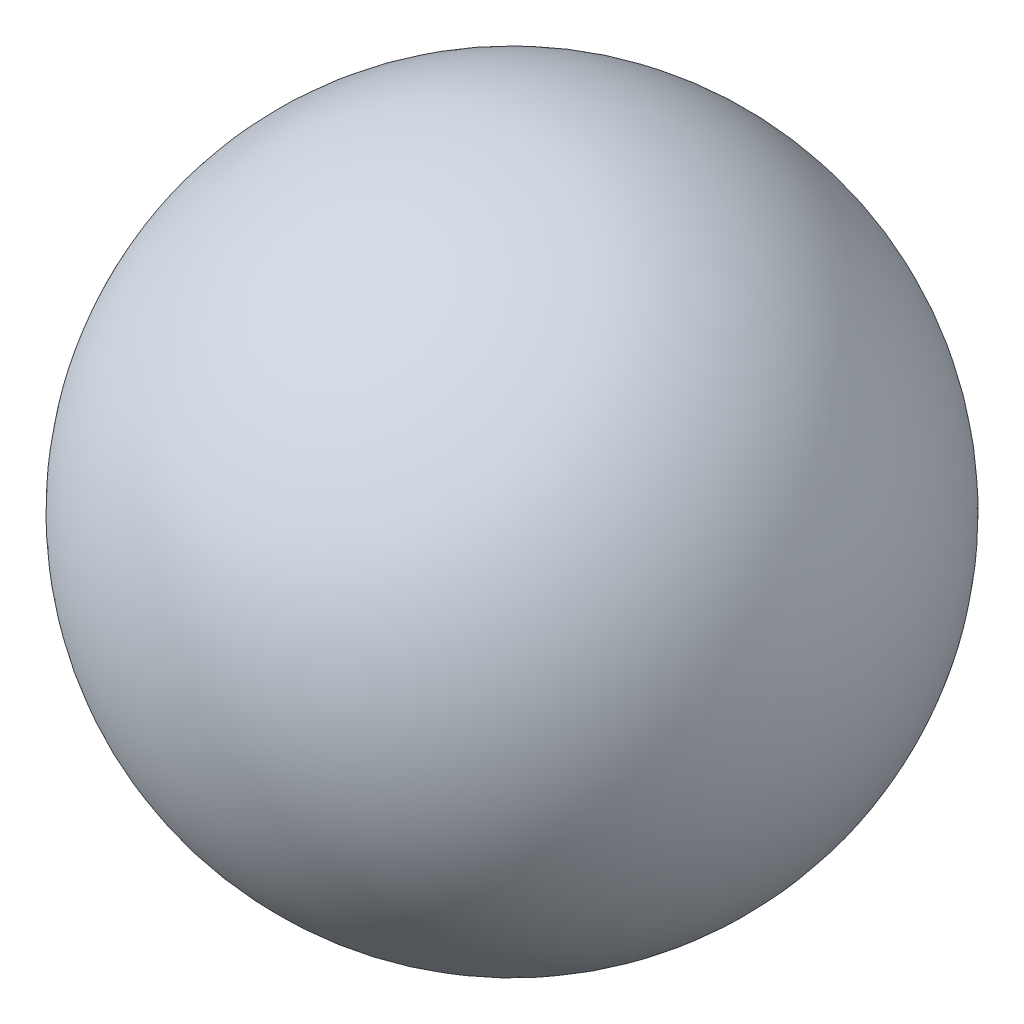
ISO-10303-21;
HEADER;
FILE_DESCRIPTION(('STEP AP214'),'2;1');
FILE_NAME('part.step','',(''),(''),'','','');
FILE_SCHEMA(('AUTOMOTIVE_DESIGN { 1 0 10303 214 1 1 1 1 }'));
ENDSEC;
DATA;
#1=APPLICATION_CONTEXT('core data for automotive mechanical design processes');
#2=APPLICATION_PROTOCOL_DEFINITION('international standard','automotive_design',2000,#1);
#3=PRODUCT_CONTEXT('',#1,'mechanical');
#4=PRODUCT('Part','Part','',(#3));
#5=PRODUCT_RELATED_PRODUCT_CATEGORY('part','',(#4));
#6=PRODUCT_DEFINITION_FORMATION('','',#4);
#7=PRODUCT_DEFINITION_CONTEXT('part definition',#1,'design');
#8=PRODUCT_DEFINITION('design','',#6,#7);
#9=PRODUCT_DEFINITION_SHAPE('','',#8);
#10=(LENGTH_UNIT() NAMED_UNIT(*) SI_UNIT(.MILLI.,.METRE.));
#11=(NAMED_UNIT(*) PLANE_ANGLE_UNIT() SI_UNIT($,.RADIAN.));
#12=(NAMED_UNIT(*) SI_UNIT($,.STERADIAN.) SOLID_ANGLE_UNIT());
#13=UNCERTAINTY_MEASURE_WITH_UNIT(LENGTH_MEASURE(1.E-05),#10,'distance_accuracy_value','');
#14=(GEOMETRIC_REPRESENTATION_CONTEXT(3) GLOBAL_UNCERTAINTY_ASSIGNED_CONTEXT((#13)) GLOBAL_UNIT_ASSIGNED_CONTEXT((#10,
#11,#12)) REPRESENTATION_CONTEXT('',''));
#15=CARTESIAN_POINT('',(0.,0.,0.));
#16=DIRECTION('',(0.,0.,1.));
#17=DIRECTION('',(1.,0.,0.));
#18=AXIS2_PLACEMENT_3D('',#15,#16,#17);
#19=CARTESIAN_POINT('',(0.,0.,0.));
#20=DIRECTION('',(-1.,0.,0.));
#21=DIRECTION('',(0.,0.,-1.));
#22=AXIS2_PLACEMENT_3D('',#19,#20,#21);
#23=SPHERICAL_SURFACE('',#22,15.);
#24=CARTESIAN_POINT('',(-15.,0.,0.));
#25=VERTEX_POINT('',#24);
#26=VERTEX_LOOP('',#25);
#27=FACE_BOUND('',#26,.T.);
#28=ADVANCED_FACE('F38',(#27),#23,.T.);
#29=CLOSED_SHELL('',(#28));
#30=MANIFOLD_SOLID_BREP('B2',#29);
#31=ADVANCED_BREP_SHAPE_REPRESENTATION('',(#18,#30),#14);
#32=SHAPE_DEFINITION_REPRESENTATION(#9,#31);
ENDSEC;
END-ISO-10303-21;
